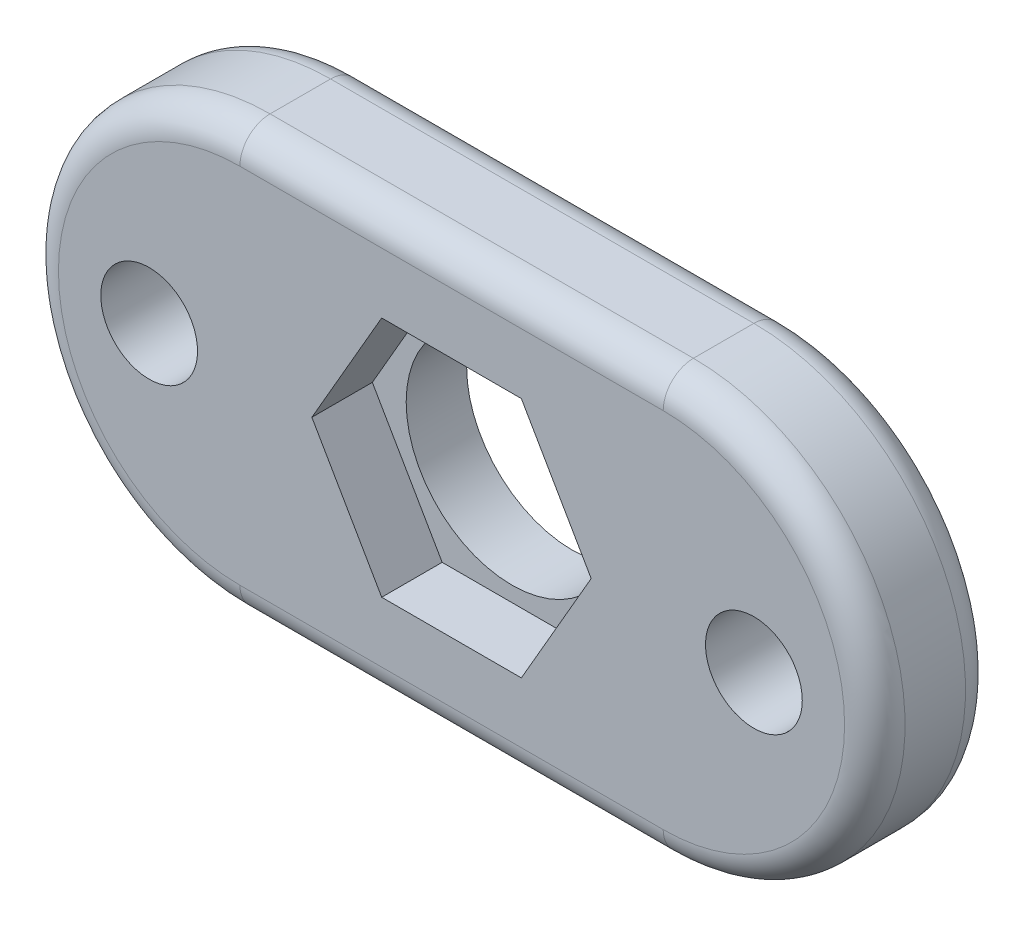
ISO-10303-21;
HEADER;
FILE_DESCRIPTION(('STEP AP214'),'2;1');
FILE_NAME('part.step','',(''),(''),'','','');
FILE_SCHEMA(('AUTOMOTIVE_DESIGN { 1 0 10303 214 1 1 1 1 }'));
ENDSEC;
DATA;
#1=APPLICATION_CONTEXT('core data for automotive mechanical design processes');
#2=APPLICATION_PROTOCOL_DEFINITION('international standard','automotive_design',2000,#1);
#3=PRODUCT_CONTEXT('',#1,'mechanical');
#4=PRODUCT('Part','Part','',(#3));
#5=PRODUCT_RELATED_PRODUCT_CATEGORY('part','',(#4));
#6=PRODUCT_DEFINITION_FORMATION('','',#4);
#7=PRODUCT_DEFINITION_CONTEXT('part definition',#1,'design');
#8=PRODUCT_DEFINITION('design','',#6,#7);
#9=PRODUCT_DEFINITION_SHAPE('','',#8);
#10=(LENGTH_UNIT() NAMED_UNIT(*) SI_UNIT(.MILLI.,.METRE.));
#11=(NAMED_UNIT(*) PLANE_ANGLE_UNIT() SI_UNIT($,.RADIAN.));
#12=(NAMED_UNIT(*) SI_UNIT($,.STERADIAN.) SOLID_ANGLE_UNIT());
#13=UNCERTAINTY_MEASURE_WITH_UNIT(LENGTH_MEASURE(1.E-05),#10,'distance_accuracy_value','');
#14=(GEOMETRIC_REPRESENTATION_CONTEXT(3) GLOBAL_UNCERTAINTY_ASSIGNED_CONTEXT((#13)) GLOBAL_UNIT_ASSIGNED_CONTEXT((#10,
#11,#12)) REPRESENTATION_CONTEXT('',''));
#15=CARTESIAN_POINT('',(0.,0.,0.));
#16=DIRECTION('',(0.,0.,1.));
#17=DIRECTION('',(1.,0.,0.));
#18=AXIS2_PLACEMENT_3D('',#15,#16,#17);
#19=CARTESIAN_POINT('',(-20.2541785109983,0.,0.));
#20=DIRECTION('',(0.,0.,1.));
#21=DIRECTION('',(1.,0.,0.));
#22=AXIS2_PLACEMENT_3D('',#19,#20,#21);
#23=CYLINDRICAL_SURFACE('',#22,3.5);
#24=CARTESIAN_POINT('',(-20.2541785109983,0.,0.));
#25=DIRECTION('',(0.,0.,1.));
#26=DIRECTION('',(1.,0.,0.));
#27=AXIS2_PLACEMENT_3D('',#24,#25,#26);
#28=CIRCLE('',#27,3.5);
#29=CARTESIAN_POINT('',(-16.7541785109983,0.,0.));
#30=VERTEX_POINT('',#29);
#31=EDGE_CURVE('E210',#30,#30,#28,.T.);
#32=ORIENTED_EDGE('',*,*,#31,.F.);
#33=EDGE_LOOP('',(#32));
#34=FACE_BOUND('',#33,.T.);
#35=CARTESIAN_POINT('',(-20.2541785109983,0.,2.));
#36=DIRECTION('',(0.,0.,1.));
#37=DIRECTION('',(1.,0.,0.));
#38=AXIS2_PLACEMENT_3D('',#35,#36,#37);
#39=CIRCLE('',#38,3.5);
#40=CARTESIAN_POINT('',(-16.7541785109983,0.,2.));
#41=VERTEX_POINT('',#40);
#42=EDGE_CURVE('E192',#41,#41,#39,.F.);
#43=ORIENTED_EDGE('',*,*,#42,.F.);
#44=EDGE_LOOP('',(#43));
#45=FACE_BOUND('',#44,.T.);
#46=ADVANCED_FACE('F35',(#34,#45),#23,.F.);
#47=CARTESIAN_POINT('',(-27.2541785109983,0.,4.));
#48=DIRECTION('',(0.,0.,-1.));
#49=DIRECTION('',(-1.,0.,0.));
#50=AXIS2_PLACEMENT_3D('',#47,#48,#49);
#51=CYLINDRICAL_SURFACE('',#50,7.);
#52=DIRECTION('',(0.,0.,-1.));
#53=VECTOR('',#52,1.);
#54=CARTESIAN_POINT('',(-27.2541785109983,-7.,4.));
#55=LINE('',#54,#53);
#56=CARTESIAN_POINT('',(-27.2541785109983,-7.,3.));
#57=VERTEX_POINT('',#56);
#58=CARTESIAN_POINT('',(-27.2541785109983,-7.,1.));
#59=VERTEX_POINT('',#58);
#60=EDGE_CURVE('E224',#57,#59,#55,.T.);
#61=ORIENTED_EDGE('',*,*,#60,.F.);
#62=CARTESIAN_POINT('',(-27.2541785109983,0.,3.));
#63=DIRECTION('',(0.,0.,1.));
#64=DIRECTION('',(1.,0.,0.));
#65=AXIS2_PLACEMENT_3D('',#62,#63,#64);
#66=CIRCLE('',#65,7.);
#67=CARTESIAN_POINT('',(-27.2541785109983,7.,3.));
#68=VERTEX_POINT('',#67);
#69=EDGE_CURVE('E11',#57,#68,#66,.F.);
#70=ORIENTED_EDGE('',*,*,#69,.T.);
#71=DIRECTION('',(0.,0.,-1.));
#72=VECTOR('',#71,1.);
#73=CARTESIAN_POINT('',(-27.2541785109983,7.,4.));
#74=LINE('',#73,#72);
#75=CARTESIAN_POINT('',(-27.2541785109983,7.,1.));
#76=VERTEX_POINT('',#75);
#77=EDGE_CURVE('E215',#68,#76,#74,.T.);
#78=ORIENTED_EDGE('',*,*,#77,.T.);
#79=CARTESIAN_POINT('',(-27.2541785109983,0.,1.));
#80=DIRECTION('',(0.,0.,1.));
#81=DIRECTION('',(1.,0.,0.));
#82=AXIS2_PLACEMENT_3D('',#79,#80,#81);
#83=CIRCLE('',#82,7.);
#84=EDGE_CURVE('E44',#76,#59,#83,.T.);
#85=ORIENTED_EDGE('',*,*,#84,.T.);
#86=EDGE_LOOP('',(#61,#70,#78,#85));
#87=FACE_BOUND('',#86,.T.);
#88=ADVANCED_FACE('F296',(#87),#51,.T.);
#89=CARTESIAN_POINT('',(-27.2541785109983,-7.,4.));
#90=DIRECTION('',(0.,1.,0.));
#91=DIRECTION('',(0.,0.,1.));
#92=AXIS2_PLACEMENT_3D('',#89,#90,#91);
#93=PLANE('',#92);
#94=DIRECTION('',(0.,0.,-1.));
#95=VECTOR('',#94,1.);
#96=CARTESIAN_POINT('',(-13.2541785109983,-7.,4.));
#97=LINE('',#96,#95);
#98=CARTESIAN_POINT('',(-13.2541785109983,-7.,3.));
#99=VERTEX_POINT('',#98);
#100=CARTESIAN_POINT('',(-13.2541785109983,-7.,1.));
#101=VERTEX_POINT('',#100);
#102=EDGE_CURVE('E221',#99,#101,#97,.T.);
#103=ORIENTED_EDGE('',*,*,#102,.F.);
#104=DIRECTION('',(1.,0.,0.));
#105=VECTOR('',#104,1.);
#106=CARTESIAN_POINT('',(-27.2541785109983,-7.,3.));
#107=LINE('',#106,#105);
#108=EDGE_CURVE('E250',#99,#57,#107,.F.);
#109=ORIENTED_EDGE('',*,*,#108,.T.);
#110=ORIENTED_EDGE('',*,*,#60,.T.);
#111=DIRECTION('',(1.,0.,0.));
#112=VECTOR('',#111,1.);
#113=CARTESIAN_POINT('',(-27.2541785109983,-7.,1.));
#114=LINE('',#113,#112);
#115=EDGE_CURVE('E248',#59,#101,#114,.T.);
#116=ORIENTED_EDGE('',*,*,#115,.T.);
#117=EDGE_LOOP('',(#103,#109,#110,#116));
#118=FACE_BOUND('',#117,.T.);
#119=ADVANCED_FACE('F313',(#118),#93,.F.);
#120=CARTESIAN_POINT('',(-13.2541785109983,0.,4.));
#121=DIRECTION('',(0.,0.,-1.));
#122=DIRECTION('',(-1.,0.,0.));
#123=AXIS2_PLACEMENT_3D('',#120,#121,#122);
#124=CYLINDRICAL_SURFACE('',#123,7.);
#125=DIRECTION('',(0.,0.,-1.));
#126=VECTOR('',#125,1.);
#127=CARTESIAN_POINT('',(-13.2541785109983,7.,4.));
#128=LINE('',#127,#126);
#129=CARTESIAN_POINT('',(-13.2541785109983,7.,3.));
#130=VERTEX_POINT('',#129);
#131=CARTESIAN_POINT('',(-13.2541785109983,7.,1.));
#132=VERTEX_POINT('',#131);
#133=EDGE_CURVE('E218',#130,#132,#128,.T.);
#134=ORIENTED_EDGE('',*,*,#133,.F.);
#135=CARTESIAN_POINT('',(-13.2541785109983,0.,3.));
#136=DIRECTION('',(0.,0.,1.));
#137=DIRECTION('',(1.,0.,0.));
#138=AXIS2_PLACEMENT_3D('',#135,#136,#137);
#139=CIRCLE('',#138,7.);
#140=EDGE_CURVE('E246',#130,#99,#139,.F.);
#141=ORIENTED_EDGE('',*,*,#140,.T.);
#142=ORIENTED_EDGE('',*,*,#102,.T.);
#143=CARTESIAN_POINT('',(-13.2541785109983,0.,1.));
#144=DIRECTION('',(0.,0.,1.));
#145=DIRECTION('',(1.,0.,0.));
#146=AXIS2_PLACEMENT_3D('',#143,#144,#145);
#147=CIRCLE('',#146,7.);
#148=EDGE_CURVE('E244',#101,#132,#147,.T.);
#149=ORIENTED_EDGE('',*,*,#148,.T.);
#150=EDGE_LOOP('',(#134,#141,#142,#149));
#151=FACE_BOUND('',#150,.T.);
#152=ADVANCED_FACE('F309',(#151),#124,.T.);
#153=CARTESIAN_POINT('',(-27.2541785109983,7.,4.));
#154=DIRECTION('',(0.,-1.,0.));
#155=DIRECTION('',(0.,0.,-1.));
#156=AXIS2_PLACEMENT_3D('',#153,#154,#155);
#157=PLANE('',#156);
#158=ORIENTED_EDGE('',*,*,#77,.F.);
#159=DIRECTION('',(-1.,0.,0.));
#160=VECTOR('',#159,1.);
#161=CARTESIAN_POINT('',(-13.2541785109983,7.,3.));
#162=LINE('',#161,#160);
#163=EDGE_CURVE('E241',#68,#130,#162,.F.);
#164=ORIENTED_EDGE('',*,*,#163,.T.);
#165=ORIENTED_EDGE('',*,*,#133,.T.);
#166=DIRECTION('',(-1.,0.,0.));
#167=VECTOR('',#166,1.);
#168=CARTESIAN_POINT('',(-27.2541785109983,7.,1.));
#169=LINE('',#168,#167);
#170=EDGE_CURVE('E238',#132,#76,#169,.T.);
#171=ORIENTED_EDGE('',*,*,#170,.T.);
#172=EDGE_LOOP('',(#158,#164,#165,#171));
#173=FACE_BOUND('',#172,.T.);
#174=ADVANCED_FACE('F293',(#173),#157,.F.);
#175=CARTESIAN_POINT('',(-27.2541785109983,0.,4.));
#176=DIRECTION('',(0.,0.,1.));
#177=DIRECTION('',(1.,0.,0.));
#178=AXIS2_PLACEMENT_3D('',#175,#176,#177);
#179=PLANE('',#178);
#180=CARTESIAN_POINT('',(-13.2541785109983,0.,4.));
#181=DIRECTION('',(0.,0.,1.));
#182=DIRECTION('',(1.,0.,0.));
#183=AXIS2_PLACEMENT_3D('',#180,#181,#182);
#184=CIRCLE('',#183,6.);
#185=CARTESIAN_POINT('',(-13.2541785109983,-6.,4.));
#186=VERTEX_POINT('',#185);
#187=CARTESIAN_POINT('',(-13.2541785109983,6.,4.));
#188=VERTEX_POINT('',#187);
#189=EDGE_CURVE('E233',#186,#188,#184,.T.);
#190=ORIENTED_EDGE('',*,*,#189,.T.);
#191=DIRECTION('',(-1.,0.,0.));
#192=VECTOR('',#191,1.);
#193=CARTESIAN_POINT('',(-27.2541785109983,6.,4.));
#194=LINE('',#193,#192);
#195=CARTESIAN_POINT('',(-27.2541785109983,6.,4.));
#196=VERTEX_POINT('',#195);
#197=EDGE_CURVE('E235',#188,#196,#194,.T.);
#198=ORIENTED_EDGE('',*,*,#197,.T.);
#199=CARTESIAN_POINT('',(-27.2541785109983,0.,4.));
#200=DIRECTION('',(0.,0.,1.));
#201=DIRECTION('',(1.,0.,0.));
#202=AXIS2_PLACEMENT_3D('',#199,#200,#201);
#203=CIRCLE('',#202,6.);
#204=CARTESIAN_POINT('',(-27.2541785109983,-6.,4.));
#205=VERTEX_POINT('',#204);
#206=EDGE_CURVE('E227',#196,#205,#203,.T.);
#207=ORIENTED_EDGE('',*,*,#206,.T.);
#208=DIRECTION('',(1.,0.,0.));
#209=VECTOR('',#208,1.);
#210=CARTESIAN_POINT('',(-13.2541785109983,-6.,4.));
#211=LINE('',#210,#209);
#212=EDGE_CURVE('E231',#205,#186,#211,.T.);
#213=ORIENTED_EDGE('',*,*,#212,.T.);
#214=EDGE_LOOP('',(#190,#198,#207,#213));
#215=FACE_BOUND('',#214,.T.);
#216=DIRECTION('',(-1.,0.,0.));
#217=VECTOR('',#216,1.);
#218=CARTESIAN_POINT('',(-17.9447774342398,4.,4.));
#219=LINE('',#218,#217);
#220=CARTESIAN_POINT('',(-17.9447774342398,4.,4.));
#221=VERTEX_POINT('',#220);
#222=CARTESIAN_POINT('',(-22.5635795877568,4.,4.));
#223=VERTEX_POINT('',#222);
#224=EDGE_CURVE('E146',#221,#223,#219,.T.);
#225=ORIENTED_EDGE('',*,*,#224,.F.);
#226=DIRECTION('',(-0.5,0.866025403784438,0.));
#227=VECTOR('',#226,1.);
#228=CARTESIAN_POINT('',(-15.6353763574813,0.,4.));
#229=LINE('',#228,#227);
#230=CARTESIAN_POINT('',(-15.6353763574813,0.,4.));
#231=VERTEX_POINT('',#230);
#232=EDGE_CURVE('E165',#231,#221,#229,.T.);
#233=ORIENTED_EDGE('',*,*,#232,.F.);
#234=DIRECTION('',(0.5,0.866025403784438,0.));
#235=VECTOR('',#234,1.);
#236=CARTESIAN_POINT('',(-17.9447774342398,-4.,4.));
#237=LINE('',#236,#235);
#238=CARTESIAN_POINT('',(-17.9447774342398,-4.,4.));
#239=VERTEX_POINT('',#238);
#240=EDGE_CURVE('E168',#239,#231,#237,.T.);
#241=ORIENTED_EDGE('',*,*,#240,.F.);
#242=DIRECTION('',(1.,0.,0.));
#243=VECTOR('',#242,1.);
#244=CARTESIAN_POINT('',(-22.5635795877568,-4.,4.));
#245=LINE('',#244,#243);
#246=CARTESIAN_POINT('',(-22.5635795877568,-4.,4.));
#247=VERTEX_POINT('',#246);
#248=EDGE_CURVE('E185',#247,#239,#245,.T.);
#249=ORIENTED_EDGE('',*,*,#248,.F.);
#250=DIRECTION('',(0.5,-0.866025403784439,0.));
#251=VECTOR('',#250,1.);
#252=CARTESIAN_POINT('',(-24.8729806645153,0.,4.));
#253=LINE('',#252,#251);
#254=CARTESIAN_POINT('',(-24.8729806645153,0.,4.));
#255=VERTEX_POINT('',#254);
#256=EDGE_CURVE('E182',#255,#247,#253,.T.);
#257=ORIENTED_EDGE('',*,*,#256,.F.);
#258=DIRECTION('',(-0.5,-0.866025403784438,0.));
#259=VECTOR('',#258,1.);
#260=CARTESIAN_POINT('',(-22.5635795877568,4.,4.));
#261=LINE('',#260,#259);
#262=EDGE_CURVE('E179',#223,#255,#261,.T.);
#263=ORIENTED_EDGE('',*,*,#262,.F.);
#264=EDGE_LOOP('',(#225,#233,#241,#249,#257,#263));
#265=FACE_BOUND('',#264,.T.);
#266=CARTESIAN_POINT('',(-10.2541785109983,0.,4.));
#267=DIRECTION('',(0.,0.,1.));
#268=DIRECTION('',(1.,0.,0.));
#269=AXIS2_PLACEMENT_3D('',#266,#267,#268);
#270=CIRCLE('',#269,1.6);
#271=CARTESIAN_POINT('',(-8.65417851099832,0.,4.));
#272=VERTEX_POINT('',#271);
#273=EDGE_CURVE('E204',#272,#272,#270,.T.);
#274=ORIENTED_EDGE('',*,*,#273,.F.);
#275=EDGE_LOOP('',(#274));
#276=FACE_BOUND('',#275,.T.);
#277=CARTESIAN_POINT('',(-30.2541785109983,0.,4.));
#278=DIRECTION('',(0.,0.,1.));
#279=DIRECTION('',(1.,0.,0.));
#280=AXIS2_PLACEMENT_3D('',#277,#278,#279);
#281=CIRCLE('',#280,1.60000000000001);
#282=CARTESIAN_POINT('',(-28.6541785109983,0.,4.));
#283=VERTEX_POINT('',#282);
#284=EDGE_CURVE('E203',#283,#283,#281,.T.);
#285=ORIENTED_EDGE('',*,*,#284,.F.);
#286=EDGE_LOOP('',(#285));
#287=FACE_BOUND('',#286,.T.);
#288=ADVANCED_FACE('F322',(#215,#265,#276,#287),#179,.T.);
#289=CARTESIAN_POINT('',(-27.2541785109983,0.,0.));
#290=DIRECTION('',(0.,0.,1.));
#291=DIRECTION('',(1.,0.,0.));
#292=AXIS2_PLACEMENT_3D('',#289,#290,#291);
#293=PLANE('',#292);
#294=CARTESIAN_POINT('',(-27.2541785109983,0.,0.));
#295=DIRECTION('',(0.,0.,1.));
#296=DIRECTION('',(1.,0.,0.));
#297=AXIS2_PLACEMENT_3D('',#294,#295,#296);
#298=CIRCLE('',#297,6.);
#299=CARTESIAN_POINT('',(-27.2541785109983,-6.,0.));
#300=VERTEX_POINT('',#299);
#301=CARTESIAN_POINT('',(-27.2541785109983,6.,0.));
#302=VERTEX_POINT('',#301);
#303=EDGE_CURVE('E252',#300,#302,#298,.F.);
#304=ORIENTED_EDGE('',*,*,#303,.T.);
#305=DIRECTION('',(-1.,0.,0.));
#306=VECTOR('',#305,1.);
#307=CARTESIAN_POINT('',(-27.2541785109983,6.,0.));
#308=LINE('',#307,#306);
#309=CARTESIAN_POINT('',(-13.2541785109983,6.,0.));
#310=VERTEX_POINT('',#309);
#311=EDGE_CURVE('E257',#302,#310,#308,.F.);
#312=ORIENTED_EDGE('',*,*,#311,.T.);
#313=CARTESIAN_POINT('',(-13.2541785109983,0.,0.));
#314=DIRECTION('',(0.,0.,1.));
#315=DIRECTION('',(1.,0.,0.));
#316=AXIS2_PLACEMENT_3D('',#313,#314,#315);
#317=CIRCLE('',#316,6.);
#318=CARTESIAN_POINT('',(-13.2541785109983,-6.,0.));
#319=VERTEX_POINT('',#318);
#320=EDGE_CURVE('E59',#310,#319,#317,.F.);
#321=ORIENTED_EDGE('',*,*,#320,.T.);
#322=DIRECTION('',(1.,0.,0.));
#323=VECTOR('',#322,1.);
#324=CARTESIAN_POINT('',(-27.2541785109983,-6.,0.));
#325=LINE('',#324,#323);
#326=EDGE_CURVE('E254',#319,#300,#325,.F.);
#327=ORIENTED_EDGE('',*,*,#326,.T.);
#328=EDGE_LOOP('',(#304,#312,#321,#327));
#329=FACE_BOUND('',#328,.T.);
#330=CARTESIAN_POINT('',(-10.2541785109983,0.,0.));
#331=DIRECTION('',(0.,0.,1.));
#332=DIRECTION('',(1.,0.,0.));
#333=AXIS2_PLACEMENT_3D('',#330,#331,#332);
#334=CIRCLE('',#333,1.6);
#335=CARTESIAN_POINT('',(-8.65417851099832,0.,0.));
#336=VERTEX_POINT('',#335);
#337=EDGE_CURVE('E200',#336,#336,#334,.T.);
#338=ORIENTED_EDGE('',*,*,#337,.T.);
#339=EDGE_LOOP('',(#338));
#340=FACE_BOUND('',#339,.T.);
#341=CARTESIAN_POINT('',(-30.2541785109983,0.,0.));
#342=DIRECTION('',(0.,0.,1.));
#343=DIRECTION('',(1.,0.,0.));
#344=AXIS2_PLACEMENT_3D('',#341,#342,#343);
#345=CIRCLE('',#344,1.60000000000001);
#346=CARTESIAN_POINT('',(-28.6541785109983,0.,0.));
#347=VERTEX_POINT('',#346);
#348=EDGE_CURVE('E207',#347,#347,#345,.T.);
#349=ORIENTED_EDGE('',*,*,#348,.T.);
#350=EDGE_LOOP('',(#349));
#351=FACE_BOUND('',#350,.T.);
#352=ORIENTED_EDGE('',*,*,#31,.T.);
#353=EDGE_LOOP('',(#352));
#354=FACE_BOUND('',#353,.T.);
#355=ADVANCED_FACE('F284',(#329,#340,#351,#354),#293,.F.);
#356=CARTESIAN_POINT('',(-30.2541785109983,0.,0.));
#357=DIRECTION('',(0.,0.,1.));
#358=DIRECTION('',(1.,0.,0.));
#359=AXIS2_PLACEMENT_3D('',#356,#357,#358);
#360=CYLINDRICAL_SURFACE('',#359,1.60000000000001);
#361=ORIENTED_EDGE('',*,*,#348,.F.);
#362=EDGE_LOOP('',(#361));
#363=FACE_BOUND('',#362,.T.);
#364=ORIENTED_EDGE('',*,*,#284,.T.);
#365=EDGE_LOOP('',(#364));
#366=FACE_BOUND('',#365,.T.);
#367=ADVANCED_FACE('F332',(#363,#366),#360,.F.);
#368=CARTESIAN_POINT('',(-10.2541785109983,0.,0.));
#369=DIRECTION('',(0.,0.,1.));
#370=DIRECTION('',(1.,0.,0.));
#371=AXIS2_PLACEMENT_3D('',#368,#369,#370);
#372=CYLINDRICAL_SURFACE('',#371,1.6);
#373=ORIENTED_EDGE('',*,*,#337,.F.);
#374=EDGE_LOOP('',(#373));
#375=FACE_BOUND('',#374,.T.);
#376=ORIENTED_EDGE('',*,*,#273,.T.);
#377=EDGE_LOOP('',(#376));
#378=FACE_BOUND('',#377,.T.);
#379=ADVANCED_FACE('F334',(#375,#378),#372,.F.);
#380=CARTESIAN_POINT('',(0.,0.,2.));
#381=DIRECTION('',(0.,0.,1.));
#382=DIRECTION('',(1.,0.,0.));
#383=AXIS2_PLACEMENT_3D('',#380,#381,#382);
#384=PLANE('',#383);
#385=DIRECTION('',(-1.,0.,0.));
#386=VECTOR('',#385,1.);
#387=CARTESIAN_POINT('',(-17.9447774342398,4.,2.));
#388=LINE('',#387,#386);
#389=CARTESIAN_POINT('',(-17.9447774342398,4.,2.));
#390=VERTEX_POINT('',#389);
#391=CARTESIAN_POINT('',(-22.5635795877568,4.,2.));
#392=VERTEX_POINT('',#391);
#393=EDGE_CURVE('E143',#390,#392,#388,.T.);
#394=ORIENTED_EDGE('',*,*,#393,.T.);
#395=DIRECTION('',(-0.5,-0.866025403784438,0.));
#396=VECTOR('',#395,1.);
#397=CARTESIAN_POINT('',(-22.5635795877568,4.,2.));
#398=LINE('',#397,#396);
#399=CARTESIAN_POINT('',(-24.8729806645153,0.,2.));
#400=VERTEX_POINT('',#399);
#401=EDGE_CURVE('E154',#392,#400,#398,.T.);
#402=ORIENTED_EDGE('',*,*,#401,.T.);
#403=DIRECTION('',(0.5,-0.866025403784439,0.));
#404=VECTOR('',#403,1.);
#405=CARTESIAN_POINT('',(-24.8729806645153,0.,2.));
#406=LINE('',#405,#404);
#407=CARTESIAN_POINT('',(-22.5635795877568,-4.,2.));
#408=VERTEX_POINT('',#407);
#409=EDGE_CURVE('E159',#400,#408,#406,.T.);
#410=ORIENTED_EDGE('',*,*,#409,.T.);
#411=DIRECTION('',(1.,0.,0.));
#412=VECTOR('',#411,1.);
#413=CARTESIAN_POINT('',(-22.5635795877568,-4.,2.));
#414=LINE('',#413,#412);
#415=CARTESIAN_POINT('',(-17.9447774342398,-4.,2.));
#416=VERTEX_POINT('',#415);
#417=EDGE_CURVE('E172',#408,#416,#414,.T.);
#418=ORIENTED_EDGE('',*,*,#417,.T.);
#419=DIRECTION('',(0.5,0.866025403784438,0.));
#420=VECTOR('',#419,1.);
#421=CARTESIAN_POINT('',(-17.9447774342398,-4.,2.));
#422=LINE('',#421,#420);
#423=CARTESIAN_POINT('',(-15.6353763574813,0.,2.));
#424=VERTEX_POINT('',#423);
#425=EDGE_CURVE('E175',#416,#424,#422,.T.);
#426=ORIENTED_EDGE('',*,*,#425,.T.);
#427=DIRECTION('',(-0.5,0.866025403784438,0.));
#428=VECTOR('',#427,1.);
#429=CARTESIAN_POINT('',(-15.6353763574813,0.,2.));
#430=LINE('',#429,#428);
#431=EDGE_CURVE('E151',#424,#390,#430,.T.);
#432=ORIENTED_EDGE('',*,*,#431,.T.);
#433=EDGE_LOOP('',(#394,#402,#410,#418,#426,#432));
#434=FACE_BOUND('',#433,.T.);
#435=ORIENTED_EDGE('',*,*,#42,.T.);
#436=EDGE_LOOP('',(#435));
#437=FACE_BOUND('',#436,.T.);
#438=ADVANCED_FACE('F161',(#434,#437),#384,.T.);
#439=CARTESIAN_POINT('',(-17.9447774342398,4.,2.));
#440=DIRECTION('',(0.,1.,0.));
#441=DIRECTION('',(0.,0.,1.));
#442=AXIS2_PLACEMENT_3D('',#439,#440,#441);
#443=PLANE('',#442);
#444=ORIENTED_EDGE('',*,*,#224,.T.);
#445=DIRECTION('',(0.,0.,1.));
#446=VECTOR('',#445,1.);
#447=CARTESIAN_POINT('',(-22.5635795877568,4.,2.));
#448=LINE('',#447,#446);
#449=EDGE_CURVE('E139',#392,#223,#448,.T.);
#450=ORIENTED_EDGE('',*,*,#449,.F.);
#451=ORIENTED_EDGE('',*,*,#393,.F.);
#452=DIRECTION('',(0.,0.,1.));
#453=VECTOR('',#452,1.);
#454=CARTESIAN_POINT('',(-17.9447774342398,4.,2.));
#455=LINE('',#454,#453);
#456=EDGE_CURVE('E190',#390,#221,#455,.T.);
#457=ORIENTED_EDGE('',*,*,#456,.T.);
#458=EDGE_LOOP('',(#444,#450,#451,#457));
#459=FACE_BOUND('',#458,.T.);
#460=ADVANCED_FACE('F141',(#459),#443,.F.);
#461=CARTESIAN_POINT('',(-15.6353763574813,0.,2.));
#462=DIRECTION('',(0.866025403784438,0.5,0.));
#463=DIRECTION('',(-0.5,0.866025403784438,0.));
#464=AXIS2_PLACEMENT_3D('',#461,#462,#463);
#465=PLANE('',#464);
#466=ORIENTED_EDGE('',*,*,#232,.T.);
#467=ORIENTED_EDGE('',*,*,#456,.F.);
#468=ORIENTED_EDGE('',*,*,#431,.F.);
#469=DIRECTION('',(0.,0.,1.));
#470=VECTOR('',#469,1.);
#471=CARTESIAN_POINT('',(-15.6353763574813,0.,2.));
#472=LINE('',#471,#470);
#473=EDGE_CURVE('E193',#424,#231,#472,.T.);
#474=ORIENTED_EDGE('',*,*,#473,.T.);
#475=EDGE_LOOP('',(#466,#467,#468,#474));
#476=FACE_BOUND('',#475,.T.);
#477=ADVANCED_FACE('F425',(#476),#465,.F.);
#478=CARTESIAN_POINT('',(-17.9447774342398,-4.,2.));
#479=DIRECTION('',(0.866025403784439,-0.5,0.));
#480=DIRECTION('',(0.5,0.866025403784439,0.));
#481=AXIS2_PLACEMENT_3D('',#478,#479,#480);
#482=PLANE('',#481);
#483=ORIENTED_EDGE('',*,*,#240,.T.);
#484=ORIENTED_EDGE('',*,*,#473,.F.);
#485=ORIENTED_EDGE('',*,*,#425,.F.);
#486=DIRECTION('',(0.,0.,1.));
#487=VECTOR('',#486,1.);
#488=CARTESIAN_POINT('',(-17.9447774342398,-4.,2.));
#489=LINE('',#488,#487);
#490=EDGE_CURVE('E195',#416,#239,#489,.T.);
#491=ORIENTED_EDGE('',*,*,#490,.T.);
#492=EDGE_LOOP('',(#483,#484,#485,#491));
#493=FACE_BOUND('',#492,.T.);
#494=ADVANCED_FACE('F417',(#493),#482,.F.);
#495=CARTESIAN_POINT('',(-22.5635795877568,-4.,2.));
#496=DIRECTION('',(0.,-1.,0.));
#497=DIRECTION('',(1.,0.,0.));
#498=AXIS2_PLACEMENT_3D('',#495,#496,#497);
#499=PLANE('',#498);
#500=ORIENTED_EDGE('',*,*,#248,.T.);
#501=ORIENTED_EDGE('',*,*,#490,.F.);
#502=ORIENTED_EDGE('',*,*,#417,.F.);
#503=DIRECTION('',(0.,0.,1.));
#504=VECTOR('',#503,1.);
#505=CARTESIAN_POINT('',(-22.5635795877568,-4.,2.));
#506=LINE('',#505,#504);
#507=EDGE_CURVE('E197',#408,#247,#506,.T.);
#508=ORIENTED_EDGE('',*,*,#507,.T.);
#509=EDGE_LOOP('',(#500,#501,#502,#508));
#510=FACE_BOUND('',#509,.T.);
#511=ADVANCED_FACE('F409',(#510),#499,.F.);
#512=CARTESIAN_POINT('',(-24.8729806645153,0.,2.));
#513=DIRECTION('',(-0.866025403784439,-0.5,0.));
#514=DIRECTION('',(0.5,-0.866025403784439,0.));
#515=AXIS2_PLACEMENT_3D('',#512,#513,#514);
#516=PLANE('',#515);
#517=ORIENTED_EDGE('',*,*,#256,.T.);
#518=ORIENTED_EDGE('',*,*,#507,.F.);
#519=ORIENTED_EDGE('',*,*,#409,.F.);
#520=DIRECTION('',(0.,0.,1.));
#521=VECTOR('',#520,1.);
#522=CARTESIAN_POINT('',(-24.8729806645153,0.,2.));
#523=LINE('',#522,#521);
#524=EDGE_CURVE('E150',#400,#255,#523,.T.);
#525=ORIENTED_EDGE('',*,*,#524,.T.);
#526=EDGE_LOOP('',(#517,#518,#519,#525));
#527=FACE_BOUND('',#526,.T.);
#528=ADVANCED_FACE('F401',(#527),#516,.F.);
#529=CARTESIAN_POINT('',(-22.5635795877568,4.,2.));
#530=DIRECTION('',(-0.866025403784438,0.5,0.));
#531=DIRECTION('',(-0.5,-0.866025403784439,0.));
#532=AXIS2_PLACEMENT_3D('',#529,#530,#531);
#533=PLANE('',#532);
#534=ORIENTED_EDGE('',*,*,#262,.T.);
#535=ORIENTED_EDGE('',*,*,#524,.F.);
#536=ORIENTED_EDGE('',*,*,#401,.F.);
#537=ORIENTED_EDGE('',*,*,#449,.T.);
#538=EDGE_LOOP('',(#534,#535,#536,#537));
#539=FACE_BOUND('',#538,.T.);
#540=ADVANCED_FACE('F155',(#539),#533,.F.);
#541=CARTESIAN_POINT('',(-27.2541785109983,-6.,3.));
#542=DIRECTION('',(-1.,0.,0.));
#543=DIRECTION('',(0.,0.,1.));
#544=AXIS2_PLACEMENT_3D('',#541,#542,#543);
#545=CYLINDRICAL_SURFACE('',#544,1.);
#546=CARTESIAN_POINT('',(-27.2541785109983,-6.,3.));
#547=DIRECTION('',(-1.,0.,0.));
#548=DIRECTION('',(0.,0.,1.));
#549=AXIS2_PLACEMENT_3D('',#546,#547,#548);
#550=CIRCLE('',#549,1.);
#551=EDGE_CURVE('E264',#57,#205,#550,.T.);
#552=ORIENTED_EDGE('',*,*,#551,.F.);
#553=ORIENTED_EDGE('',*,*,#108,.F.);
#554=CARTESIAN_POINT('',(-13.2541785109983,-6.,3.));
#555=DIRECTION('',(1.,0.,0.));
#556=DIRECTION('',(0.,0.,-1.));
#557=AXIS2_PLACEMENT_3D('',#554,#555,#556);
#558=CIRCLE('',#557,1.);
#559=EDGE_CURVE('E180',#186,#99,#558,.T.);
#560=ORIENTED_EDGE('',*,*,#559,.F.);
#561=ORIENTED_EDGE('',*,*,#212,.F.);
#562=EDGE_LOOP('',(#552,#553,#560,#561));
#563=FACE_BOUND('',#562,.T.);
#564=ADVANCED_FACE('F316',(#563),#545,.T.);
#565=CARTESIAN_POINT('',(-13.2541785109983,0.,3.));
#566=DIRECTION('',(0.,0.,1.));
#567=DIRECTION('',(1.,0.,0.));
#568=AXIS2_PLACEMENT_3D('',#565,#566,#567);
#569=TOROIDAL_SURFACE('',#568,6.,1.);
#570=ORIENTED_EDGE('',*,*,#559,.T.);
#571=ORIENTED_EDGE('',*,*,#140,.F.);
#572=CARTESIAN_POINT('',(-13.2541785109983,6.,3.));
#573=DIRECTION('',(-1.,0.,0.));
#574=DIRECTION('',(0.,0.,1.));
#575=AXIS2_PLACEMENT_3D('',#572,#573,#574);
#576=CIRCLE('',#575,1.);
#577=EDGE_CURVE('E262',#188,#130,#576,.T.);
#578=ORIENTED_EDGE('',*,*,#577,.F.);
#579=ORIENTED_EDGE('',*,*,#189,.F.);
#580=EDGE_LOOP('',(#570,#571,#578,#579));
#581=FACE_BOUND('',#580,.T.);
#582=ADVANCED_FACE('F320',(#581),#569,.T.);
#583=CARTESIAN_POINT('',(-27.2541785109983,0.,3.));
#584=DIRECTION('',(0.,0.,1.));
#585=DIRECTION('',(1.,0.,0.));
#586=AXIS2_PLACEMENT_3D('',#583,#584,#585);
#587=TOROIDAL_SURFACE('',#586,6.,1.);
#588=ORIENTED_EDGE('',*,*,#551,.T.);
#589=ORIENTED_EDGE('',*,*,#206,.F.);
#590=CARTESIAN_POINT('',(-27.2541785109983,6.,3.));
#591=DIRECTION('',(1.,0.,0.));
#592=DIRECTION('',(0.,0.,-1.));
#593=AXIS2_PLACEMENT_3D('',#590,#591,#592);
#594=CIRCLE('',#593,1.);
#595=EDGE_CURVE('E260',#68,#196,#594,.T.);
#596=ORIENTED_EDGE('',*,*,#595,.F.);
#597=ORIENTED_EDGE('',*,*,#69,.F.);
#598=EDGE_LOOP('',(#588,#589,#596,#597));
#599=FACE_BOUND('',#598,.T.);
#600=ADVANCED_FACE('F301',(#599),#587,.T.);
#601=CARTESIAN_POINT('',(-27.2541785109983,6.,3.));
#602=DIRECTION('',(1.,0.,0.));
#603=DIRECTION('',(0.,0.,-1.));
#604=AXIS2_PLACEMENT_3D('',#601,#602,#603);
#605=CYLINDRICAL_SURFACE('',#604,1.);
#606=ORIENTED_EDGE('',*,*,#577,.T.);
#607=ORIENTED_EDGE('',*,*,#163,.F.);
#608=ORIENTED_EDGE('',*,*,#595,.T.);
#609=ORIENTED_EDGE('',*,*,#197,.F.);
#610=EDGE_LOOP('',(#606,#607,#608,#609));
#611=FACE_BOUND('',#610,.T.);
#612=ADVANCED_FACE('F305',(#611),#605,.T.);
#613=CARTESIAN_POINT('',(-27.2541785109983,-6.,1.));
#614=DIRECTION('',(1.,0.,0.));
#615=DIRECTION('',(0.,0.,-1.));
#616=AXIS2_PLACEMENT_3D('',#613,#614,#615);
#617=CYLINDRICAL_SURFACE('',#616,1.);
#618=CARTESIAN_POINT('',(-27.2541785109983,-6.,1.));
#619=DIRECTION('',(-1.,0.,0.));
#620=DIRECTION('',(0.,0.,1.));
#621=AXIS2_PLACEMENT_3D('',#618,#619,#620);
#622=CIRCLE('',#621,1.);
#623=EDGE_CURVE('E271',#300,#59,#622,.T.);
#624=ORIENTED_EDGE('',*,*,#623,.F.);
#625=ORIENTED_EDGE('',*,*,#326,.F.);
#626=CARTESIAN_POINT('',(-13.2541785109983,-6.,1.));
#627=DIRECTION('',(1.,0.,0.));
#628=DIRECTION('',(0.,0.,-1.));
#629=AXIS2_PLACEMENT_3D('',#626,#627,#628);
#630=CIRCLE('',#629,1.);
#631=EDGE_CURVE('E39',#101,#319,#630,.T.);
#632=ORIENTED_EDGE('',*,*,#631,.F.);
#633=ORIENTED_EDGE('',*,*,#115,.F.);
#634=EDGE_LOOP('',(#624,#625,#632,#633));
#635=FACE_BOUND('',#634,.T.);
#636=ADVANCED_FACE('F37',(#635),#617,.T.);
#637=CARTESIAN_POINT('',(-13.2541785109983,0.,1.));
#638=DIRECTION('',(0.,0.,1.));
#639=DIRECTION('',(1.,0.,0.));
#640=AXIS2_PLACEMENT_3D('',#637,#638,#639);
#641=TOROIDAL_SURFACE('',#640,6.,1.);
#642=ORIENTED_EDGE('',*,*,#631,.T.);
#643=ORIENTED_EDGE('',*,*,#320,.F.);
#644=CARTESIAN_POINT('',(-13.2541785109983,6.,1.));
#645=DIRECTION('',(-1.,0.,0.));
#646=DIRECTION('',(0.,0.,1.));
#647=AXIS2_PLACEMENT_3D('',#644,#645,#646);
#648=CIRCLE('',#647,1.);
#649=EDGE_CURVE('E52',#132,#310,#648,.T.);
#650=ORIENTED_EDGE('',*,*,#649,.F.);
#651=ORIENTED_EDGE('',*,*,#148,.F.);
#652=EDGE_LOOP('',(#642,#643,#650,#651));
#653=FACE_BOUND('',#652,.T.);
#654=ADVANCED_FACE('F281',(#653),#641,.T.);
#655=CARTESIAN_POINT('',(-27.2541785109983,0.,1.));
#656=DIRECTION('',(0.,0.,1.));
#657=DIRECTION('',(1.,0.,0.));
#658=AXIS2_PLACEMENT_3D('',#655,#656,#657);
#659=TOROIDAL_SURFACE('',#658,6.,1.);
#660=ORIENTED_EDGE('',*,*,#623,.T.);
#661=ORIENTED_EDGE('',*,*,#84,.F.);
#662=CARTESIAN_POINT('',(-27.2541785109983,6.,1.));
#663=DIRECTION('',(1.,0.,0.));
#664=DIRECTION('',(0.,0.,-1.));
#665=AXIS2_PLACEMENT_3D('',#662,#663,#664);
#666=CIRCLE('',#665,1.);
#667=EDGE_CURVE('E269',#302,#76,#666,.T.);
#668=ORIENTED_EDGE('',*,*,#667,.F.);
#669=ORIENTED_EDGE('',*,*,#303,.F.);
#670=EDGE_LOOP('',(#660,#661,#668,#669));
#671=FACE_BOUND('',#670,.T.);
#672=ADVANCED_FACE('F288',(#671),#659,.T.);
#673=CARTESIAN_POINT('',(-27.2541785109983,6.,1.));
#674=DIRECTION('',(-1.,0.,0.));
#675=DIRECTION('',(0.,0.,1.));
#676=AXIS2_PLACEMENT_3D('',#673,#674,#675);
#677=CYLINDRICAL_SURFACE('',#676,1.);
#678=ORIENTED_EDGE('',*,*,#649,.T.);
#679=ORIENTED_EDGE('',*,*,#311,.F.);
#680=ORIENTED_EDGE('',*,*,#667,.T.);
#681=ORIENTED_EDGE('',*,*,#170,.F.);
#682=EDGE_LOOP('',(#678,#679,#680,#681));
#683=FACE_BOUND('',#682,.T.);
#684=ADVANCED_FACE('F287',(#683),#677,.T.);
#685=CLOSED_SHELL('',(#46,#88,#119,#152,#174,#288,#355,#367,#379,#438,#460,#477,#494,#511,#528,
#540,#564,#582,#600,#612,#636,#654,#672,#684));
#686=MANIFOLD_SOLID_BREP('B2',#685);
#687=ADVANCED_BREP_SHAPE_REPRESENTATION('',(#18,#686),#14);
#688=SHAPE_DEFINITION_REPRESENTATION(#9,#687);
ENDSEC;
END-ISO-10303-21;
